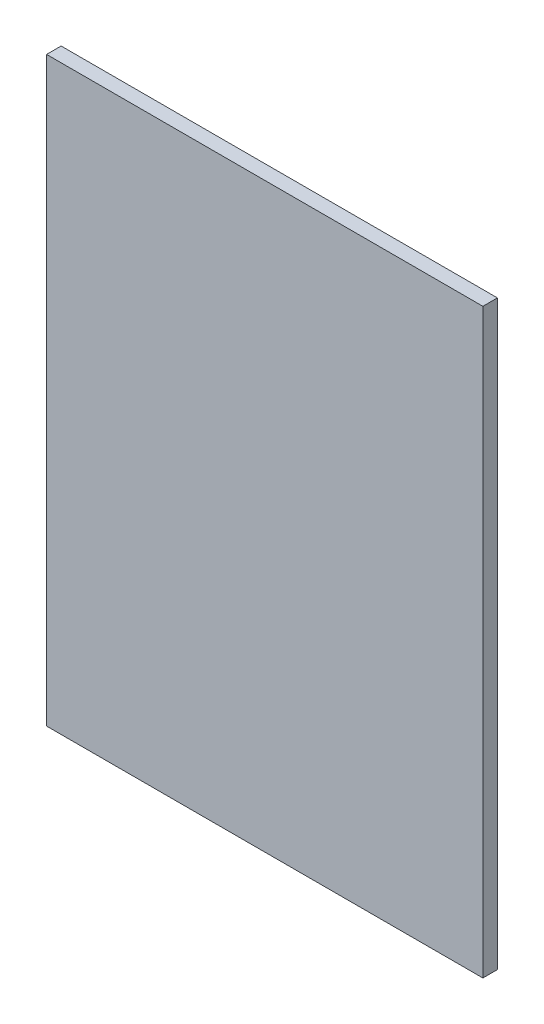
ISO-10303-21;
HEADER;
FILE_DESCRIPTION(('STEP AP214'),'2;1');
FILE_NAME('part.step','',(''),(''),'','','');
FILE_SCHEMA(('AUTOMOTIVE_DESIGN { 1 0 10303 214 1 1 1 1 }'));
ENDSEC;
DATA;
#1=APPLICATION_CONTEXT('core data for automotive mechanical design processes');
#2=APPLICATION_PROTOCOL_DEFINITION('international standard','automotive_design',2000,#1);
#3=PRODUCT_CONTEXT('',#1,'mechanical');
#4=PRODUCT('Part','Part','',(#3));
#5=PRODUCT_RELATED_PRODUCT_CATEGORY('part','',(#4));
#6=PRODUCT_DEFINITION_FORMATION('','',#4);
#7=PRODUCT_DEFINITION_CONTEXT('part definition',#1,'design');
#8=PRODUCT_DEFINITION('design','',#6,#7);
#9=PRODUCT_DEFINITION_SHAPE('','',#8);
#10=(LENGTH_UNIT() NAMED_UNIT(*) SI_UNIT(.MILLI.,.METRE.));
#11=(NAMED_UNIT(*) PLANE_ANGLE_UNIT() SI_UNIT($,.RADIAN.));
#12=(NAMED_UNIT(*) SI_UNIT($,.STERADIAN.) SOLID_ANGLE_UNIT());
#13=UNCERTAINTY_MEASURE_WITH_UNIT(LENGTH_MEASURE(1.E-05),#10,'distance_accuracy_value','');
#14=(GEOMETRIC_REPRESENTATION_CONTEXT(3) GLOBAL_UNCERTAINTY_ASSIGNED_CONTEXT((#13)) GLOBAL_UNIT_ASSIGNED_CONTEXT((#10,
#11,#12)) REPRESENTATION_CONTEXT('',''));
#15=CARTESIAN_POINT('',(0.,0.,0.));
#16=DIRECTION('',(0.,0.,1.));
#17=DIRECTION('',(1.,0.,0.));
#18=AXIS2_PLACEMENT_3D('',#15,#16,#17);
#19=CARTESIAN_POINT('',(0.,1100.09695005203,10.0000000000003));
#20=DIRECTION('',(1.,0.,0.));
#21=DIRECTION('',(0.,0.,-1.));
#22=AXIS2_PLACEMENT_3D('',#19,#20,#21);
#23=PLANE('',#22);
#24=DIRECTION('',(0.,1.,0.));
#25=VECTOR('',#24,1.);
#26=CARTESIAN_POINT('',(0.,1100.09695005203,2.53676555219679E-13));
#27=LINE('',#26,#25);
#28=CARTESIAN_POINT('',(0.,700.096950052034,0.));
#29=VERTEX_POINT('',#28);
#30=CARTESIAN_POINT('',(0.,1100.09695005203,2.53676555219679E-13));
#31=VERTEX_POINT('',#30);
#32=EDGE_CURVE('E95',#29,#31,#27,.T.);
#33=ORIENTED_EDGE('',*,*,#32,.F.);
#34=DIRECTION('',(0.,0.,-1.));
#35=VECTOR('',#34,1.);
#36=CARTESIAN_POINT('',(0.,700.096950052034,10.0000000000001));
#37=LINE('',#36,#35);
#38=CARTESIAN_POINT('',(0.,700.096950052034,10.0000000000001));
#39=VERTEX_POINT('',#38);
#40=EDGE_CURVE('E94',#39,#29,#37,.T.);
#41=ORIENTED_EDGE('',*,*,#40,.F.);
#42=DIRECTION('',(0.,1.,0.));
#43=VECTOR('',#42,1.);
#44=CARTESIAN_POINT('',(0.,1100.09695005203,10.0000000000003));
#45=LINE('',#44,#43);
#46=CARTESIAN_POINT('',(0.,1100.09695005203,10.0000000000003));
#47=VERTEX_POINT('',#46);
#48=EDGE_CURVE('E89',#39,#47,#45,.T.);
#49=ORIENTED_EDGE('',*,*,#48,.T.);
#50=DIRECTION('',(0.,0.,-1.));
#51=VECTOR('',#50,1.);
#52=CARTESIAN_POINT('',(0.,1100.09695005203,10.0000000000003));
#53=LINE('',#52,#51);
#54=EDGE_CURVE('E11',#47,#31,#53,.T.);
#55=ORIENTED_EDGE('',*,*,#54,.T.);
#56=EDGE_LOOP('',(#33,#41,#49,#55));
#57=FACE_BOUND('',#56,.T.);
#58=ADVANCED_FACE('F32',(#57),#23,.F.);
#59=CARTESIAN_POINT('',(0.,1100.09695005203,10.0000000000003));
#60=DIRECTION('',(0.,-1.,0.));
#61=DIRECTION('',(0.,0.,1.));
#62=AXIS2_PLACEMENT_3D('',#59,#60,#61);
#63=PLANE('',#62);
#64=DIRECTION('',(1.,0.,0.));
#65=VECTOR('',#64,1.);
#66=CARTESIAN_POINT('',(0.,1100.09695005203,2.53676555219679E-13));
#67=LINE('',#66,#65);
#68=CARTESIAN_POINT('',(300.,1100.09695005203,2.53676555219679E-13));
#69=VERTEX_POINT('',#68);
#70=EDGE_CURVE('E97',#31,#69,#67,.T.);
#71=ORIENTED_EDGE('',*,*,#70,.F.);
#72=ORIENTED_EDGE('',*,*,#54,.F.);
#73=DIRECTION('',(1.,0.,0.));
#74=VECTOR('',#73,1.);
#75=CARTESIAN_POINT('',(0.,1100.09695005203,10.0000000000003));
#76=LINE('',#75,#74);
#77=CARTESIAN_POINT('',(300.,1100.09695005203,10.0000000000003));
#78=VERTEX_POINT('',#77);
#79=EDGE_CURVE('E73',#47,#78,#76,.T.);
#80=ORIENTED_EDGE('',*,*,#79,.T.);
#81=DIRECTION('',(0.,0.,-1.));
#82=VECTOR('',#81,1.);
#83=CARTESIAN_POINT('',(300.,1100.09695005203,10.0000000000003));
#84=LINE('',#83,#82);
#85=EDGE_CURVE('E40',#78,#69,#84,.T.);
#86=ORIENTED_EDGE('',*,*,#85,.T.);
#87=EDGE_LOOP('',(#71,#72,#80,#86));
#88=FACE_BOUND('',#87,.T.);
#89=ADVANCED_FACE('F87',(#88),#63,.F.);
#90=CARTESIAN_POINT('',(300.,1100.09695005203,10.0000000000003));
#91=DIRECTION('',(-1.,0.,0.));
#92=DIRECTION('',(0.,0.,1.));
#93=AXIS2_PLACEMENT_3D('',#90,#91,#92);
#94=PLANE('',#93);
#95=DIRECTION('',(0.,-1.,0.));
#96=VECTOR('',#95,1.);
#97=CARTESIAN_POINT('',(300.,1100.09695005203,2.53676555219679E-13));
#98=LINE('',#97,#96);
#99=CARTESIAN_POINT('',(300.,700.096950052034,0.));
#100=VERTEX_POINT('',#99);
#101=EDGE_CURVE('E83',#69,#100,#98,.T.);
#102=ORIENTED_EDGE('',*,*,#101,.F.);
#103=ORIENTED_EDGE('',*,*,#85,.F.);
#104=DIRECTION('',(0.,-1.,0.));
#105=VECTOR('',#104,1.);
#106=CARTESIAN_POINT('',(300.,1100.09695005203,10.0000000000003));
#107=LINE('',#106,#105);
#108=CARTESIAN_POINT('',(300.,700.096950052034,10.0000000000001));
#109=VERTEX_POINT('',#108);
#110=EDGE_CURVE('E76',#78,#109,#107,.T.);
#111=ORIENTED_EDGE('',*,*,#110,.T.);
#112=DIRECTION('',(0.,0.,-1.));
#113=VECTOR('',#112,1.);
#114=CARTESIAN_POINT('',(300.,700.096950052034,10.0000000000001));
#115=LINE('',#114,#113);
#116=EDGE_CURVE('E86',#109,#100,#115,.T.);
#117=ORIENTED_EDGE('',*,*,#116,.T.);
#118=EDGE_LOOP('',(#102,#103,#111,#117));
#119=FACE_BOUND('',#118,.T.);
#120=ADVANCED_FACE('F82',(#119),#94,.F.);
#121=CARTESIAN_POINT('',(0.,700.096950052034,10.0000000000001));
#122=DIRECTION('',(0.,1.,0.));
#123=DIRECTION('',(0.,0.,-1.));
#124=AXIS2_PLACEMENT_3D('',#121,#122,#123);
#125=PLANE('',#124);
#126=DIRECTION('',(-1.,0.,0.));
#127=VECTOR('',#126,1.);
#128=CARTESIAN_POINT('',(0.,700.096950052034,0.));
#129=LINE('',#128,#127);
#130=EDGE_CURVE('E62',#100,#29,#129,.T.);
#131=ORIENTED_EDGE('',*,*,#130,.F.);
#132=ORIENTED_EDGE('',*,*,#116,.F.);
#133=DIRECTION('',(-1.,0.,0.));
#134=VECTOR('',#133,1.);
#135=CARTESIAN_POINT('',(0.,700.096950052034,10.0000000000001));
#136=LINE('',#135,#134);
#137=EDGE_CURVE('E48',#109,#39,#136,.T.);
#138=ORIENTED_EDGE('',*,*,#137,.T.);
#139=ORIENTED_EDGE('',*,*,#40,.T.);
#140=EDGE_LOOP('',(#131,#132,#138,#139));
#141=FACE_BOUND('',#140,.T.);
#142=ADVANCED_FACE('F106',(#141),#125,.F.);
#143=CARTESIAN_POINT('',(0.,700.096950052034,10.0000000000001));
#144=DIRECTION('',(0.,0.,-1.));
#145=DIRECTION('',(-1.,0.,0.));
#146=AXIS2_PLACEMENT_3D('',#143,#144,#145);
#147=PLANE('',#146);
#148=ORIENTED_EDGE('',*,*,#48,.F.);
#149=ORIENTED_EDGE('',*,*,#137,.F.);
#150=ORIENTED_EDGE('',*,*,#110,.F.);
#151=ORIENTED_EDGE('',*,*,#79,.F.);
#152=EDGE_LOOP('',(#148,#149,#150,#151));
#153=FACE_BOUND('',#152,.T.);
#154=ADVANCED_FACE('F78',(#153),#147,.F.);
#155=CARTESIAN_POINT('',(0.,700.096950052034,0.));
#156=DIRECTION('',(0.,0.,-1.));
#157=DIRECTION('',(-1.,0.,0.));
#158=AXIS2_PLACEMENT_3D('',#155,#156,#157);
#159=PLANE('',#158);
#160=ORIENTED_EDGE('',*,*,#32,.T.);
#161=ORIENTED_EDGE('',*,*,#70,.T.);
#162=ORIENTED_EDGE('',*,*,#101,.T.);
#163=ORIENTED_EDGE('',*,*,#130,.T.);
#164=EDGE_LOOP('',(#160,#161,#162,#163));
#165=FACE_BOUND('',#164,.T.);
#166=ADVANCED_FACE('F102',(#165),#159,.T.);
#167=CLOSED_SHELL('',(#58,#89,#120,#142,#154,#166));
#168=MANIFOLD_SOLID_BREP('B2',#167);
#169=ADVANCED_BREP_SHAPE_REPRESENTATION('',(#18,#168),#14);
#170=SHAPE_DEFINITION_REPRESENTATION(#9,#169);
ENDSEC;
END-ISO-10303-21;
